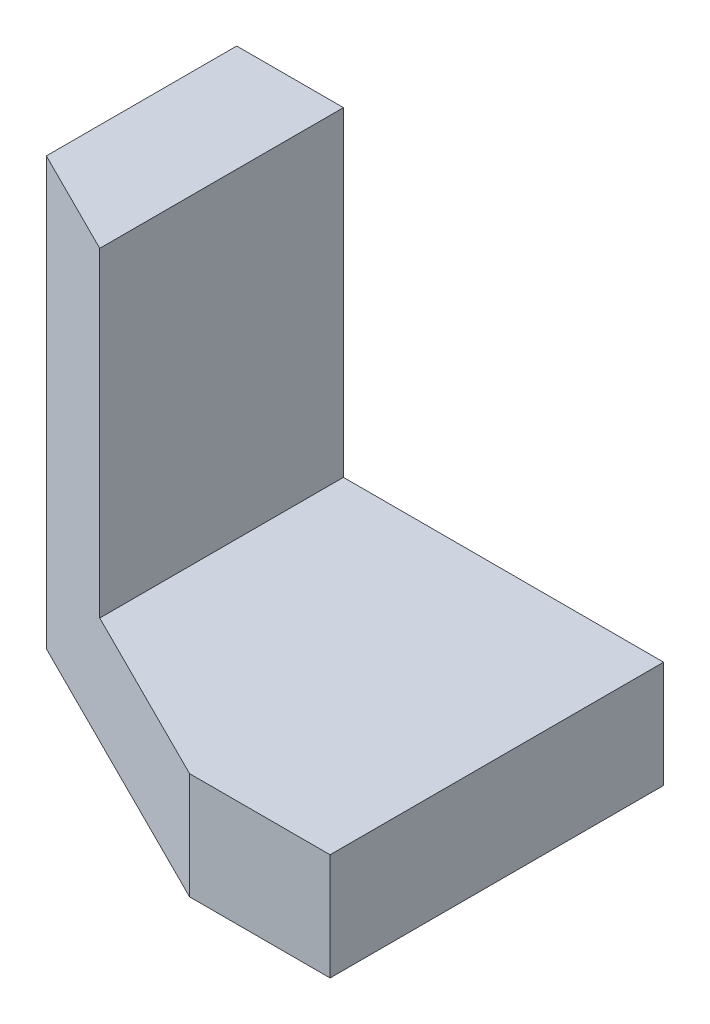
ISO-10303-21;
HEADER;
FILE_DESCRIPTION(('STEP AP214'),'2;1');
FILE_NAME('part.step','',(''),(''),'','','');
FILE_SCHEMA(('AUTOMOTIVE_DESIGN { 1 0 10303 214 1 1 1 1 }'));
ENDSEC;
DATA;
#1=APPLICATION_CONTEXT('core data for automotive mechanical design processes');
#2=APPLICATION_PROTOCOL_DEFINITION('international standard','automotive_design',2000,#1);
#3=PRODUCT_CONTEXT('',#1,'mechanical');
#4=PRODUCT('Part','Part','',(#3));
#5=PRODUCT_RELATED_PRODUCT_CATEGORY('part','',(#4));
#6=PRODUCT_DEFINITION_FORMATION('','',#4);
#7=PRODUCT_DEFINITION_CONTEXT('part definition',#1,'design');
#8=PRODUCT_DEFINITION('design','',#6,#7);
#9=PRODUCT_DEFINITION_SHAPE('','',#8);
#10=(LENGTH_UNIT() NAMED_UNIT(*) SI_UNIT(.MILLI.,.METRE.));
#11=(NAMED_UNIT(*) PLANE_ANGLE_UNIT() SI_UNIT($,.RADIAN.));
#12=(NAMED_UNIT(*) SI_UNIT($,.STERADIAN.) SOLID_ANGLE_UNIT());
#13=UNCERTAINTY_MEASURE_WITH_UNIT(LENGTH_MEASURE(1.E-05),#10,'distance_accuracy_value','');
#14=(GEOMETRIC_REPRESENTATION_CONTEXT(3) GLOBAL_UNCERTAINTY_ASSIGNED_CONTEXT((#13)) GLOBAL_UNIT_ASSIGNED_CONTEXT((#10,
#11,#12)) REPRESENTATION_CONTEXT('',''));
#15=CARTESIAN_POINT('',(0.,0.,0.));
#16=DIRECTION('',(0.,0.,1.));
#17=DIRECTION('',(1.,0.,0.));
#18=AXIS2_PLACEMENT_3D('',#15,#16,#17);
#19=CARTESIAN_POINT('',(0.,10.16,0.));
#20=DIRECTION('',(0.,-1.,0.));
#21=DIRECTION('',(0.,0.,-1.));
#22=AXIS2_PLACEMENT_3D('',#19,#20,#21);
#23=PLANE('',#22);
#24=DIRECTION('',(0.,0.,-1.));
#25=VECTOR('',#24,1.);
#26=CARTESIAN_POINT('',(10.16,10.16,0.));
#27=LINE('',#26,#25);
#28=CARTESIAN_POINT('',(10.16,10.16,5.08));
#29=VERTEX_POINT('',#28);
#30=CARTESIAN_POINT('',(10.16,10.16,-18.1189296091612));
#31=VERTEX_POINT('',#30);
#32=EDGE_CURVE('E56',#29,#31,#27,.T.);
#33=ORIENTED_EDGE('',*,*,#32,.F.);
#34=DIRECTION('',(0.894427190999916,0.,0.447213595499958));
#35=VECTOR('',#34,1.);
#36=CARTESIAN_POINT('',(27.2621407816777,10.16,13.6310703908388));
#37=LINE('',#36,#35);
#38=CARTESIAN_POINT('',(27.2621407816777,10.16,13.6310703908388));
#39=VERTEX_POINT('',#38);
#40=EDGE_CURVE('E128',#29,#39,#37,.T.);
#41=ORIENTED_EDGE('',*,*,#40,.T.);
#42=DIRECTION('',(1.,0.,0.));
#43=VECTOR('',#42,1.);
#44=CARTESIAN_POINT('',(27.2621407816777,10.16,13.6310703908388));
#45=LINE('',#44,#43);
#46=CARTESIAN_POINT('',(40.64,10.16,13.6310703908388));
#47=VERTEX_POINT('',#46);
#48=EDGE_CURVE('E130',#39,#47,#45,.T.);
#49=ORIENTED_EDGE('',*,*,#48,.T.);
#50=DIRECTION('',(0.,0.,-1.));
#51=VECTOR('',#50,1.);
#52=CARTESIAN_POINT('',(40.64,10.16,-18.1189296091612));
#53=LINE('',#52,#51);
#54=CARTESIAN_POINT('',(40.64,10.16,-18.1189296091612));
#55=VERTEX_POINT('',#54);
#56=EDGE_CURVE('E132',#47,#55,#53,.T.);
#57=ORIENTED_EDGE('',*,*,#56,.T.);
#58=DIRECTION('',(-1.,0.,0.));
#59=VECTOR('',#58,1.);
#60=CARTESIAN_POINT('',(27.2621407816777,10.16,-18.1189296091612));
#61=LINE('',#60,#59);
#62=EDGE_CURVE('E52',#55,#31,#61,.T.);
#63=ORIENTED_EDGE('',*,*,#62,.T.);
#64=EDGE_LOOP('',(#33,#41,#49,#57,#63));
#65=FACE_BOUND('',#64,.T.);
#66=ADVANCED_FACE('F37',(#65),#23,.F.);
#67=CARTESIAN_POINT('',(27.2621407816777,10.16,13.6310703908388));
#68=DIRECTION('',(0.447213595499958,0.,-0.894427190999916));
#69=DIRECTION('',(-0.894427190999916,0.,-0.447213595499958));
#70=AXIS2_PLACEMENT_3D('',#67,#68,#69);
#71=PLANE('',#70);
#72=DIRECTION('',(0.894427190999916,0.,0.447213595499958));
#73=VECTOR('',#72,1.);
#74=CARTESIAN_POINT('',(27.2621407816777,0.,13.6310703908388));
#75=LINE('',#74,#73);
#76=CARTESIAN_POINT('',(0.,0.,0.));
#77=VERTEX_POINT('',#76);
#78=CARTESIAN_POINT('',(27.2621407816777,0.,13.6310703908388));
#79=VERTEX_POINT('',#78);
#80=EDGE_CURVE('E127',#77,#79,#75,.T.);
#81=ORIENTED_EDGE('',*,*,#80,.T.);
#82=DIRECTION('',(0.,-1.,0.));
#83=VECTOR('',#82,1.);
#84=CARTESIAN_POINT('',(27.2621407816777,10.16,13.6310703908388));
#85=LINE('',#84,#83);
#86=EDGE_CURVE('E11',#39,#79,#85,.T.);
#87=ORIENTED_EDGE('',*,*,#86,.F.);
#88=ORIENTED_EDGE('',*,*,#40,.F.);
#89=DIRECTION('',(0.,-1.,0.));
#90=VECTOR('',#89,1.);
#91=CARTESIAN_POINT('',(10.16,40.64,5.08000000000001));
#92=LINE('',#91,#90);
#93=CARTESIAN_POINT('',(10.16,40.64,5.08000000000001));
#94=VERTEX_POINT('',#93);
#95=EDGE_CURVE('E109',#94,#29,#92,.T.);
#96=ORIENTED_EDGE('',*,*,#95,.F.);
#97=DIRECTION('',(0.894427190999915,0.,0.447213595499959));
#98=VECTOR('',#97,1.);
#99=CARTESIAN_POINT('',(10.16,40.64,5.08000000000001));
#100=LINE('',#99,#98);
#101=CARTESIAN_POINT('',(0.,40.64,0.));
#102=VERTEX_POINT('',#101);
#103=EDGE_CURVE('E107',#102,#94,#100,.T.);
#104=ORIENTED_EDGE('',*,*,#103,.F.);
#105=DIRECTION('',(0.,-1.,0.));
#106=VECTOR('',#105,1.);
#107=CARTESIAN_POINT('',(0.,10.16,0.));
#108=LINE('',#107,#106);
#109=EDGE_CURVE('E94',#102,#77,#108,.T.);
#110=ORIENTED_EDGE('',*,*,#109,.T.);
#111=EDGE_LOOP('',(#81,#87,#88,#96,#104,#110));
#112=FACE_BOUND('',#111,.T.);
#113=ADVANCED_FACE('F39',(#112),#71,.F.);
#114=CARTESIAN_POINT('',(27.2621407816777,10.16,13.6310703908388));
#115=DIRECTION('',(0.,0.,-1.));
#116=DIRECTION('',(-1.,0.,0.));
#117=AXIS2_PLACEMENT_3D('',#114,#115,#116);
#118=PLANE('',#117);
#119=DIRECTION('',(1.,0.,0.));
#120=VECTOR('',#119,1.);
#121=CARTESIAN_POINT('',(27.2621407816777,0.,13.6310703908388));
#122=LINE('',#121,#120);
#123=CARTESIAN_POINT('',(40.64,0.,13.6310703908388));
#124=VERTEX_POINT('',#123);
#125=EDGE_CURVE('E136',#79,#124,#122,.T.);
#126=ORIENTED_EDGE('',*,*,#125,.T.);
#127=DIRECTION('',(0.,-1.,0.));
#128=VECTOR('',#127,1.);
#129=CARTESIAN_POINT('',(40.64,10.16,13.6310703908388));
#130=LINE('',#129,#128);
#131=EDGE_CURVE('E45',#47,#124,#130,.T.);
#132=ORIENTED_EDGE('',*,*,#131,.F.);
#133=ORIENTED_EDGE('',*,*,#48,.F.);
#134=ORIENTED_EDGE('',*,*,#86,.T.);
#135=EDGE_LOOP('',(#126,#132,#133,#134));
#136=FACE_BOUND('',#135,.T.);
#137=ADVANCED_FACE('F177',(#136),#118,.F.);
#138=CARTESIAN_POINT('',(40.64,10.16,-18.1189296091612));
#139=DIRECTION('',(-1.,0.,0.));
#140=DIRECTION('',(0.,0.,1.));
#141=AXIS2_PLACEMENT_3D('',#138,#139,#140);
#142=PLANE('',#141);
#143=DIRECTION('',(0.,0.,-1.));
#144=VECTOR('',#143,1.);
#145=CARTESIAN_POINT('',(40.64,0.,-18.1189296091612));
#146=LINE('',#145,#144);
#147=CARTESIAN_POINT('',(40.64,0.,-18.1189296091612));
#148=VERTEX_POINT('',#147);
#149=EDGE_CURVE('E138',#124,#148,#146,.T.);
#150=ORIENTED_EDGE('',*,*,#149,.T.);
#151=DIRECTION('',(0.,-1.,0.));
#152=VECTOR('',#151,1.);
#153=CARTESIAN_POINT('',(40.64,10.16,-18.1189296091612));
#154=LINE('',#153,#152);
#155=EDGE_CURVE('E145',#55,#148,#154,.T.);
#156=ORIENTED_EDGE('',*,*,#155,.F.);
#157=ORIENTED_EDGE('',*,*,#56,.F.);
#158=ORIENTED_EDGE('',*,*,#131,.T.);
#159=EDGE_LOOP('',(#150,#156,#157,#158));
#160=FACE_BOUND('',#159,.T.);
#161=ADVANCED_FACE('F152',(#160),#142,.F.);
#162=CARTESIAN_POINT('',(0.,10.16,-18.1189296091612));
#163=DIRECTION('',(0.,0.,1.));
#164=DIRECTION('',(1.,0.,0.));
#165=AXIS2_PLACEMENT_3D('',#162,#163,#164);
#166=PLANE('',#165);
#167=DIRECTION('',(0.,-1.,0.));
#168=VECTOR('',#167,1.);
#169=CARTESIAN_POINT('',(0.,10.16,-18.1189296091612));
#170=LINE('',#169,#168);
#171=CARTESIAN_POINT('',(0.,40.64,-18.1189296091612));
#172=VERTEX_POINT('',#171);
#173=CARTESIAN_POINT('',(0.,0.,-18.1189296091612));
#174=VERTEX_POINT('',#173);
#175=EDGE_CURVE('E104',#172,#174,#170,.T.);
#176=ORIENTED_EDGE('',*,*,#175,.F.);
#177=DIRECTION('',(-1.,0.,0.));
#178=VECTOR('',#177,1.);
#179=CARTESIAN_POINT('',(0.,40.64,-18.1189296091612));
#180=LINE('',#179,#178);
#181=CARTESIAN_POINT('',(10.16,40.64,-18.1189296091612));
#182=VERTEX_POINT('',#181);
#183=EDGE_CURVE('E117',#182,#172,#180,.T.);
#184=ORIENTED_EDGE('',*,*,#183,.F.);
#185=DIRECTION('',(0.,-1.,0.));
#186=VECTOR('',#185,1.);
#187=CARTESIAN_POINT('',(10.16,40.64,-18.1189296091612));
#188=LINE('',#187,#186);
#189=EDGE_CURVE('E122',#182,#31,#188,.T.);
#190=ORIENTED_EDGE('',*,*,#189,.T.);
#191=ORIENTED_EDGE('',*,*,#62,.F.);
#192=ORIENTED_EDGE('',*,*,#155,.T.);
#193=DIRECTION('',(-1.,0.,0.));
#194=VECTOR('',#193,1.);
#195=CARTESIAN_POINT('',(0.,0.,-18.1189296091612));
#196=LINE('',#195,#194);
#197=EDGE_CURVE('E141',#148,#174,#196,.T.);
#198=ORIENTED_EDGE('',*,*,#197,.T.);
#199=EDGE_LOOP('',(#176,#184,#190,#191,#192,#198));
#200=FACE_BOUND('',#199,.T.);
#201=ADVANCED_FACE('F160',(#200),#166,.F.);
#202=CARTESIAN_POINT('',(0.,10.16,0.));
#203=DIRECTION('',(1.,0.,0.));
#204=DIRECTION('',(0.,0.,-1.));
#205=AXIS2_PLACEMENT_3D('',#202,#203,#204);
#206=PLANE('',#205);
#207=DIRECTION('',(0.,0.,1.));
#208=VECTOR('',#207,1.);
#209=CARTESIAN_POINT('',(0.,0.,0.));
#210=LINE('',#209,#208);
#211=EDGE_CURVE('E101',#174,#77,#210,.T.);
#212=ORIENTED_EDGE('',*,*,#211,.T.);
#213=ORIENTED_EDGE('',*,*,#109,.F.);
#214=DIRECTION('',(0.,0.,1.));
#215=VECTOR('',#214,1.);
#216=CARTESIAN_POINT('',(0.,40.64,0.));
#217=LINE('',#216,#215);
#218=EDGE_CURVE('E99',#172,#102,#217,.T.);
#219=ORIENTED_EDGE('',*,*,#218,.F.);
#220=ORIENTED_EDGE('',*,*,#175,.T.);
#221=EDGE_LOOP('',(#212,#213,#219,#220));
#222=FACE_BOUND('',#221,.T.);
#223=ADVANCED_FACE('F96',(#222),#206,.F.);
#224=CARTESIAN_POINT('',(0.,0.,0.));
#225=DIRECTION('',(0.,-1.,0.));
#226=DIRECTION('',(0.,0.,-1.));
#227=AXIS2_PLACEMENT_3D('',#224,#225,#226);
#228=PLANE('',#227);
#229=ORIENTED_EDGE('',*,*,#211,.F.);
#230=ORIENTED_EDGE('',*,*,#197,.F.);
#231=ORIENTED_EDGE('',*,*,#149,.F.);
#232=ORIENTED_EDGE('',*,*,#125,.F.);
#233=ORIENTED_EDGE('',*,*,#80,.F.);
#234=EDGE_LOOP('',(#229,#230,#231,#232,#233));
#235=FACE_BOUND('',#234,.T.);
#236=ADVANCED_FACE('F158',(#235),#228,.T.);
#237=CARTESIAN_POINT('',(10.16,40.64,-18.1189296091612));
#238=DIRECTION('',(-1.,0.,0.));
#239=DIRECTION('',(0.,0.,1.));
#240=AXIS2_PLACEMENT_3D('',#237,#238,#239);
#241=PLANE('',#240);
#242=ORIENTED_EDGE('',*,*,#95,.T.);
#243=ORIENTED_EDGE('',*,*,#32,.T.);
#244=ORIENTED_EDGE('',*,*,#189,.F.);
#245=DIRECTION('',(0.,0.,-1.));
#246=VECTOR('',#245,1.);
#247=CARTESIAN_POINT('',(10.16,40.64,-18.1189296091612));
#248=LINE('',#247,#246);
#249=EDGE_CURVE('E112',#94,#182,#248,.T.);
#250=ORIENTED_EDGE('',*,*,#249,.F.);
#251=EDGE_LOOP('',(#242,#243,#244,#250));
#252=FACE_BOUND('',#251,.T.);
#253=ADVANCED_FACE('F163',(#252),#241,.F.);
#254=CARTESIAN_POINT('',(0.,40.64,0.));
#255=DIRECTION('',(0.,-1.,0.));
#256=DIRECTION('',(0.,0.,-1.));
#257=AXIS2_PLACEMENT_3D('',#254,#255,#256);
#258=PLANE('',#257);
#259=ORIENTED_EDGE('',*,*,#218,.T.);
#260=ORIENTED_EDGE('',*,*,#103,.T.);
#261=ORIENTED_EDGE('',*,*,#249,.T.);
#262=ORIENTED_EDGE('',*,*,#183,.T.);
#263=EDGE_LOOP('',(#259,#260,#261,#262));
#264=FACE_BOUND('',#263,.T.);
#265=ADVANCED_FACE('F115',(#264),#258,.F.);
#266=CLOSED_SHELL('',(#66,#113,#137,#161,#201,#223,#236,#253,#265));
#267=MANIFOLD_SOLID_BREP('B2',#266);
#268=ADVANCED_BREP_SHAPE_REPRESENTATION('',(#18,#267),#14);
#269=SHAPE_DEFINITION_REPRESENTATION(#9,#268);
ENDSEC;
END-ISO-10303-21;
